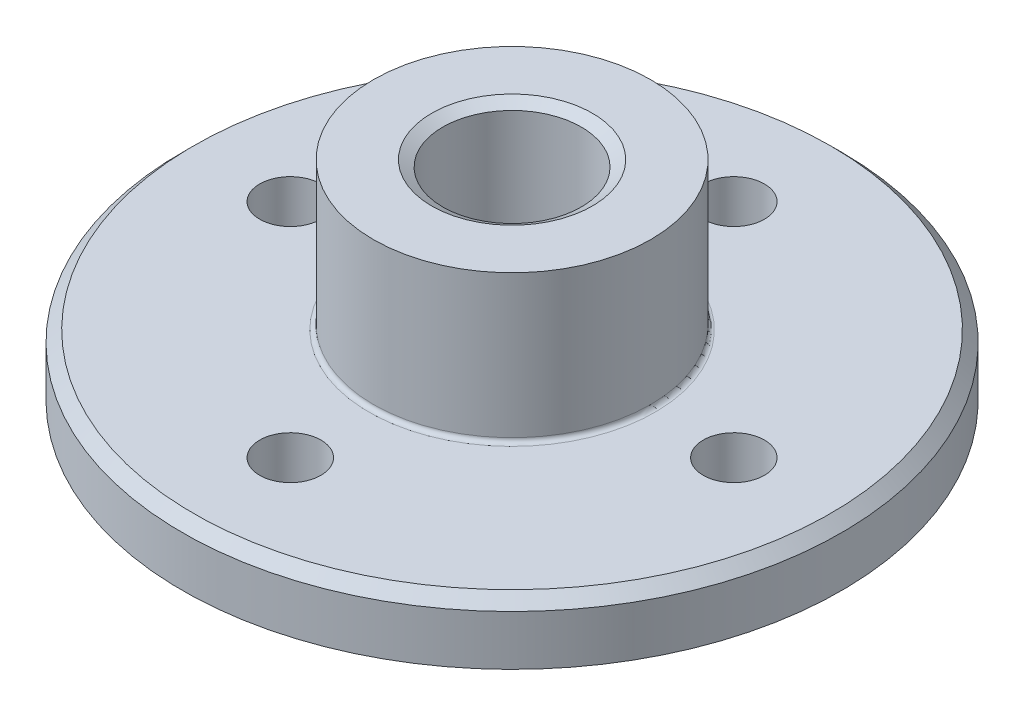
ISO-10303-21;
HEADER;
FILE_DESCRIPTION(('STEP AP214'),'2;1');
FILE_NAME('part.step','',(''),(''),'','','');
FILE_SCHEMA(('AUTOMOTIVE_DESIGN { 1 0 10303 214 1 1 1 1 }'));
ENDSEC;
DATA;
#1=APPLICATION_CONTEXT('core data for automotive mechanical design processes');
#2=APPLICATION_PROTOCOL_DEFINITION('international standard','automotive_design',2000,#1);
#3=PRODUCT_CONTEXT('',#1,'mechanical');
#4=PRODUCT('Part','Part','',(#3));
#5=PRODUCT_RELATED_PRODUCT_CATEGORY('part','',(#4));
#6=PRODUCT_DEFINITION_FORMATION('','',#4);
#7=PRODUCT_DEFINITION_CONTEXT('part definition',#1,'design');
#8=PRODUCT_DEFINITION('design','',#6,#7);
#9=PRODUCT_DEFINITION_SHAPE('','',#8);
#10=(LENGTH_UNIT() NAMED_UNIT(*) SI_UNIT(.MILLI.,.METRE.));
#11=(NAMED_UNIT(*) PLANE_ANGLE_UNIT() SI_UNIT($,.RADIAN.));
#12=(NAMED_UNIT(*) SI_UNIT($,.STERADIAN.) SOLID_ANGLE_UNIT());
#13=UNCERTAINTY_MEASURE_WITH_UNIT(LENGTH_MEASURE(1.E-05),#10,'distance_accuracy_value','');
#14=(GEOMETRIC_REPRESENTATION_CONTEXT(3) GLOBAL_UNCERTAINTY_ASSIGNED_CONTEXT((#13)) GLOBAL_UNIT_ASSIGNED_CONTEXT((#10,
#11,#12)) REPRESENTATION_CONTEXT('',''));
#15=CARTESIAN_POINT('',(0.,0.,0.));
#16=DIRECTION('',(0.,0.,1.));
#17=DIRECTION('',(1.,0.,0.));
#18=AXIS2_PLACEMENT_3D('',#15,#16,#17);
#19=CARTESIAN_POINT('',(-18.8733197120138,-8.9662,0.));
#20=DIRECTION('',(0.,1.,0.));
#21=DIRECTION('',(0.,0.,1.));
#22=AXIS2_PLACEMENT_3D('',#19,#20,#21);
#23=PLANE('',#22);
#24=CARTESIAN_POINT('',(-12.7,-8.9662,1.33025439009923E-13));
#25=DIRECTION('',(0.,-1.,0.));
#26=DIRECTION('',(0.,0.,-1.));
#27=AXIS2_PLACEMENT_3D('',#24,#25,#26);
#28=CIRCLE('',#27,1.75259999999999);
#29=CARTESIAN_POINT('',(-12.7,-8.9662,-1.75259999999985));
#30=VERTEX_POINT('',#29);
#31=EDGE_CURVE('E103',#30,#30,#28,.T.);
#32=ORIENTED_EDGE('',*,*,#31,.F.);
#33=EDGE_LOOP('',(#32));
#34=FACE_BOUND('',#33,.T.);
#35=CARTESIAN_POINT('',(0.,-8.9662,-12.7));
#36=DIRECTION('',(0.,-1.,0.));
#37=DIRECTION('',(0.,0.,-1.));
#38=AXIS2_PLACEMENT_3D('',#35,#36,#37);
#39=CIRCLE('',#38,1.75259999999999);
#40=CARTESIAN_POINT('',(0.,-8.9662,-14.4526));
#41=VERTEX_POINT('',#40);
#42=EDGE_CURVE('E97',#41,#41,#39,.T.);
#43=ORIENTED_EDGE('',*,*,#42,.F.);
#44=EDGE_LOOP('',(#43));
#45=FACE_BOUND('',#44,.T.);
#46=CARTESIAN_POINT('',(12.7,-8.9662,0.));
#47=DIRECTION('',(0.,-1.,0.));
#48=DIRECTION('',(0.,0.,-1.));
#49=AXIS2_PLACEMENT_3D('',#46,#47,#48);
#50=CIRCLE('',#49,1.75259999999999);
#51=CARTESIAN_POINT('',(12.7,-8.9662,-1.75260000000003));
#52=VERTEX_POINT('',#51);
#53=EDGE_CURVE('E91',#52,#52,#50,.T.);
#54=ORIENTED_EDGE('',*,*,#53,.F.);
#55=EDGE_LOOP('',(#54));
#56=FACE_BOUND('',#55,.T.);
#57=CARTESIAN_POINT('',(0.,-8.9662,0.));
#58=DIRECTION('',(0.,-1.,0.));
#59=DIRECTION('',(0.,0.,-1.));
#60=AXIS2_PLACEMENT_3D('',#57,#58,#59);
#61=CIRCLE('',#60,18.8733197120138);
#62=CARTESIAN_POINT('',(0.,-8.9662,-18.8733197120138));
#63=VERTEX_POINT('',#62);
#64=EDGE_CURVE('E73',#63,#63,#61,.T.);
#65=ORIENTED_EDGE('',*,*,#64,.T.);
#66=EDGE_LOOP('',(#65));
#67=FACE_BOUND('',#66,.T.);
#68=CARTESIAN_POINT('',(0.,-8.9662,0.));
#69=DIRECTION('',(0.,1.,0.));
#70=DIRECTION('',(0.,0.,1.));
#71=AXIS2_PLACEMENT_3D('',#68,#69,#70);
#72=CIRCLE('',#71,4.60375);
#73=CARTESIAN_POINT('',(0.,-8.9662,4.60375));
#74=VERTEX_POINT('',#73);
#75=EDGE_CURVE('E79',#74,#74,#72,.T.);
#76=ORIENTED_EDGE('',*,*,#75,.T.);
#77=EDGE_LOOP('',(#76));
#78=FACE_BOUND('',#77,.T.);
#79=CARTESIAN_POINT('',(0.,-8.9662,12.7));
#80=DIRECTION('',(0.,-1.,0.));
#81=DIRECTION('',(0.,0.,-1.));
#82=AXIS2_PLACEMENT_3D('',#79,#80,#81);
#83=CIRCLE('',#82,1.75259999999999);
#84=CARTESIAN_POINT('',(0.,-8.9662,10.9474));
#85=VERTEX_POINT('',#84);
#86=EDGE_CURVE('E85',#85,#85,#83,.T.);
#87=ORIENTED_EDGE('',*,*,#86,.F.);
#88=EDGE_LOOP('',(#87));
#89=FACE_BOUND('',#88,.T.);
#90=ADVANCED_FACE('F44',(#34,#45,#56,#67,#78,#89),#23,.F.);
#91=CARTESIAN_POINT('',(0.,-5.461,0.));
#92=DIRECTION('',(0.,-1.,0.));
#93=DIRECTION('',(1.,0.,0.));
#94=AXIS2_PLACEMENT_3D('',#91,#92,#93);
#95=CYLINDRICAL_SURFACE('',#94,7.9375);
#96=CARTESIAN_POINT('',(0.,-5.207,0.));
#97=DIRECTION('',(0.,-1.,0.));
#98=DIRECTION('',(0.,0.,-1.));
#99=AXIS2_PLACEMENT_3D('',#96,#97,#98);
#100=CIRCLE('',#99,7.9375);
#101=CARTESIAN_POINT('',(0.,-5.207,-7.9375));
#102=VERTEX_POINT('',#101);
#103=EDGE_CURVE('E55',#102,#102,#100,.F.);
#104=ORIENTED_EDGE('',*,*,#103,.T.);
#105=EDGE_LOOP('',(#104));
#106=FACE_BOUND('',#105,.T.);
#107=CARTESIAN_POINT('',(0.,2.9718,0.));
#108=DIRECTION('',(0.,-1.,0.));
#109=DIRECTION('',(1.,0.,0.));
#110=AXIS2_PLACEMENT_3D('',#107,#108,#109);
#111=CIRCLE('',#110,7.9375);
#112=CARTESIAN_POINT('',(7.9375,2.9718,0.));
#113=VERTEX_POINT('',#112);
#114=EDGE_CURVE('E64',#113,#113,#111,.T.);
#115=ORIENTED_EDGE('',*,*,#114,.T.);
#116=EDGE_LOOP('',(#115));
#117=FACE_BOUND('',#116,.T.);
#118=ADVANCED_FACE('F111',(#106,#117),#95,.T.);
#119=CARTESIAN_POINT('',(0.,2.9718,0.));
#120=DIRECTION('',(0.,-1.,0.));
#121=DIRECTION('',(1.,0.,0.));
#122=AXIS2_PLACEMENT_3D('',#119,#120,#121);
#123=PLANE('',#122);
#124=CARTESIAN_POINT('',(0.,2.9718,0.));
#125=DIRECTION('',(0.,1.,0.));
#126=DIRECTION('',(0.,0.,1.));
#127=AXIS2_PLACEMENT_3D('',#124,#125,#126);
#128=CIRCLE('',#127,4.60375);
#129=CARTESIAN_POINT('',(0.,2.9718,4.60375));
#130=VERTEX_POINT('',#129);
#131=EDGE_CURVE('E67',#130,#130,#128,.T.);
#132=ORIENTED_EDGE('',*,*,#131,.F.);
#133=EDGE_LOOP('',(#132));
#134=FACE_BOUND('',#133,.T.);
#135=ORIENTED_EDGE('',*,*,#114,.F.);
#136=EDGE_LOOP('',(#135));
#137=FACE_BOUND('',#136,.T.);
#138=ADVANCED_FACE('F157',(#134,#137),#123,.F.);
#139=CARTESIAN_POINT('',(0.,2.9718,0.));
#140=DIRECTION('',(0.,1.,0.));
#141=DIRECTION('',(0.,0.,1.));
#142=AXIS2_PLACEMENT_3D('',#139,#140,#141);
#143=CONICAL_SURFACE('',#142,4.60375,1.0471975511966);
#144=CARTESIAN_POINT('',(0.,2.60518257906459,0.));
#145=DIRECTION('',(0.,1.,0.));
#146=DIRECTION('',(0.,0.,1.));
#147=AXIS2_PLACEMENT_3D('',#144,#145,#146);
#148=CIRCLE('',#147,3.96875);
#149=CARTESIAN_POINT('',(0.,2.60518257906459,3.96875));
#150=VERTEX_POINT('',#149);
#151=EDGE_CURVE('E70',#150,#150,#148,.T.);
#152=ORIENTED_EDGE('',*,*,#151,.F.);
#153=EDGE_LOOP('',(#152));
#154=FACE_BOUND('',#153,.T.);
#155=ORIENTED_EDGE('',*,*,#131,.T.);
#156=EDGE_LOOP('',(#155));
#157=FACE_BOUND('',#156,.T.);
#158=ADVANCED_FACE('F153',(#154,#157),#143,.F.);
#159=CARTESIAN_POINT('',(0.,2.9718,0.));
#160=DIRECTION('',(0.,1.,0.));
#161=DIRECTION('',(0.,0.,1.));
#162=AXIS2_PLACEMENT_3D('',#159,#160,#161);
#163=CYLINDRICAL_SURFACE('',#162,3.96875);
#164=ORIENTED_EDGE('',*,*,#151,.T.);
#165=EDGE_LOOP('',(#164));
#166=FACE_BOUND('',#165,.T.);
#167=CARTESIAN_POINT('',(0.,-8.59958257906459,0.));
#168=DIRECTION('',(0.,1.,0.));
#169=DIRECTION('',(0.,0.,1.));
#170=AXIS2_PLACEMENT_3D('',#167,#168,#169);
#171=CIRCLE('',#170,3.96875);
#172=CARTESIAN_POINT('',(0.,-8.59958257906459,3.96875));
#173=VERTEX_POINT('',#172);
#174=EDGE_CURVE('E76',#173,#173,#171,.T.);
#175=ORIENTED_EDGE('',*,*,#174,.F.);
#176=EDGE_LOOP('',(#175));
#177=FACE_BOUND('',#176,.T.);
#178=ADVANCED_FACE('F150',(#166,#177),#163,.F.);
#179=CARTESIAN_POINT('',(0.,-5.461,0.));
#180=DIRECTION('',(0.,-1.,0.));
#181=DIRECTION('',(0.,0.,-1.));
#182=AXIS2_PLACEMENT_3D('',#179,#180,#181);
#183=PLANE('',#182);
#184=CARTESIAN_POINT('',(0.,-5.461,0.));
#185=DIRECTION('',(0.,-1.,0.));
#186=DIRECTION('',(0.,0.,-1.));
#187=AXIS2_PLACEMENT_3D('',#184,#185,#186);
#188=CIRCLE('',#187,18.2383197120138);
#189=CARTESIAN_POINT('',(0.,-5.461,-18.2383197120138));
#190=VERTEX_POINT('',#189);
#191=EDGE_CURVE('E12',#190,#190,#188,.F.);
#192=ORIENTED_EDGE('',*,*,#191,.T.);
#193=EDGE_LOOP('',(#192));
#194=FACE_BOUND('',#193,.T.);
#195=CARTESIAN_POINT('',(-12.7,-5.461,1.33025439009923E-13));
#196=DIRECTION('',(0.,-1.,0.));
#197=DIRECTION('',(0.,0.,-1.));
#198=AXIS2_PLACEMENT_3D('',#195,#196,#197);
#199=CIRCLE('',#198,1.75259999999999);
#200=CARTESIAN_POINT('',(-12.7,-5.461,-1.75259999999986));
#201=VERTEX_POINT('',#200);
#202=EDGE_CURVE('E100',#201,#201,#199,.T.);
#203=ORIENTED_EDGE('',*,*,#202,.T.);
#204=EDGE_LOOP('',(#203));
#205=FACE_BOUND('',#204,.T.);
#206=CARTESIAN_POINT('',(0.,-5.461,-12.7));
#207=DIRECTION('',(0.,-1.,0.));
#208=DIRECTION('',(0.,0.,-1.));
#209=AXIS2_PLACEMENT_3D('',#206,#207,#208);
#210=CIRCLE('',#209,1.75259999999999);
#211=CARTESIAN_POINT('',(0.,-5.461,-14.4526));
#212=VERTEX_POINT('',#211);
#213=EDGE_CURVE('E94',#212,#212,#210,.T.);
#214=ORIENTED_EDGE('',*,*,#213,.T.);
#215=EDGE_LOOP('',(#214));
#216=FACE_BOUND('',#215,.T.);
#217=CARTESIAN_POINT('',(12.7,-5.461,0.));
#218=DIRECTION('',(0.,-1.,0.));
#219=DIRECTION('',(0.,0.,-1.));
#220=AXIS2_PLACEMENT_3D('',#217,#218,#219);
#221=CIRCLE('',#220,1.75259999999999);
#222=CARTESIAN_POINT('',(12.7,-5.461,-1.75260000000004));
#223=VERTEX_POINT('',#222);
#224=EDGE_CURVE('E88',#223,#223,#221,.T.);
#225=ORIENTED_EDGE('',*,*,#224,.T.);
#226=EDGE_LOOP('',(#225));
#227=FACE_BOUND('',#226,.T.);
#228=CARTESIAN_POINT('',(0.,-5.461,12.7));
#229=DIRECTION('',(0.,-1.,0.));
#230=DIRECTION('',(0.,0.,-1.));
#231=AXIS2_PLACEMENT_3D('',#228,#229,#230);
#232=CIRCLE('',#231,1.75259999999999);
#233=CARTESIAN_POINT('',(0.,-5.461,10.9474));
#234=VERTEX_POINT('',#233);
#235=EDGE_CURVE('E82',#234,#234,#232,.T.);
#236=ORIENTED_EDGE('',*,*,#235,.T.);
#237=EDGE_LOOP('',(#236));
#238=FACE_BOUND('',#237,.T.);
#239=CARTESIAN_POINT('',(0.,-5.461,0.));
#240=DIRECTION('',(0.,-1.,0.));
#241=DIRECTION('',(0.,0.,-1.));
#242=AXIS2_PLACEMENT_3D('',#239,#240,#241);
#243=CIRCLE('',#242,8.1915);
#244=CARTESIAN_POINT('',(0.,-5.461,-8.1915));
#245=VERTEX_POINT('',#244);
#246=EDGE_CURVE('E59',#245,#245,#243,.T.);
#247=ORIENTED_EDGE('',*,*,#246,.T.);
#248=EDGE_LOOP('',(#247));
#249=FACE_BOUND('',#248,.T.);
#250=ADVANCED_FACE('F147',(#194,#205,#216,#227,#238,#249),#183,.F.);
#251=CARTESIAN_POINT('',(0.,-29.1939599054509,0.));
#252=DIRECTION('',(0.,-1.,0.));
#253=DIRECTION('',(0.,0.,-1.));
#254=AXIS2_PLACEMENT_3D('',#251,#252,#253);
#255=CYLINDRICAL_SURFACE('',#254,18.8733197120138);
#256=CARTESIAN_POINT('',(0.,-6.09600000000001,0.));
#257=DIRECTION('',(0.,-1.,0.));
#258=DIRECTION('',(0.,0.,-1.));
#259=AXIS2_PLACEMENT_3D('',#256,#257,#258);
#260=CIRCLE('',#259,18.8733197120138);
#261=CARTESIAN_POINT('',(0.,-6.09600000000001,-18.8733197120138));
#262=VERTEX_POINT('',#261);
#263=EDGE_CURVE('E51',#262,#262,#260,.T.);
#264=ORIENTED_EDGE('',*,*,#263,.T.);
#265=EDGE_LOOP('',(#264));
#266=FACE_BOUND('',#265,.T.);
#267=ORIENTED_EDGE('',*,*,#64,.F.);
#268=EDGE_LOOP('',(#267));
#269=FACE_BOUND('',#268,.T.);
#270=ADVANCED_FACE('F142',(#266,#269),#255,.T.);
#271=CARTESIAN_POINT('',(0.,-8.59958257906459,0.));
#272=DIRECTION('',(0.,-1.,0.));
#273=DIRECTION('',(0.,0.,-1.));
#274=AXIS2_PLACEMENT_3D('',#271,#272,#273);
#275=CONICAL_SURFACE('',#274,3.96875,1.04719755119659);
#276=ORIENTED_EDGE('',*,*,#75,.F.);
#277=EDGE_LOOP('',(#276));
#278=FACE_BOUND('',#277,.T.);
#279=ORIENTED_EDGE('',*,*,#174,.T.);
#280=EDGE_LOOP('',(#279));
#281=FACE_BOUND('',#280,.T.);
#282=ADVANCED_FACE('F136',(#278,#281),#275,.F.);
#283=CARTESIAN_POINT('',(0.,-5.207,0.));
#284=DIRECTION('',(0.,-1.,0.));
#285=DIRECTION('',(0.,0.,-1.));
#286=AXIS2_PLACEMENT_3D('',#283,#284,#285);
#287=TOROIDAL_SURFACE('',#286,8.1915,0.254);
#288=ORIENTED_EDGE('',*,*,#103,.F.);
#289=EDGE_LOOP('',(#288));
#290=FACE_BOUND('',#289,.T.);
#291=ORIENTED_EDGE('',*,*,#246,.F.);
#292=EDGE_LOOP('',(#291));
#293=FACE_BOUND('',#292,.T.);
#294=ADVANCED_FACE('F126',(#290,#293),#287,.F.);
#295=CARTESIAN_POINT('',(0.,-8.9662,12.7));
#296=DIRECTION('',(0.,-1.,0.));
#297=DIRECTION('',(0.,0.,-1.));
#298=AXIS2_PLACEMENT_3D('',#295,#296,#297);
#299=CYLINDRICAL_SURFACE('',#298,1.75259999999999);
#300=ORIENTED_EDGE('',*,*,#235,.F.);
#301=EDGE_LOOP('',(#300));
#302=FACE_BOUND('',#301,.T.);
#303=ORIENTED_EDGE('',*,*,#86,.T.);
#304=EDGE_LOOP('',(#303));
#305=FACE_BOUND('',#304,.T.);
#306=ADVANCED_FACE('F123',(#302,#305),#299,.F.);
#307=CARTESIAN_POINT('',(12.7,-8.9662,0.));
#308=DIRECTION('',(0.,-1.,0.));
#309=DIRECTION('',(0.,0.,-1.));
#310=AXIS2_PLACEMENT_3D('',#307,#308,#309);
#311=CYLINDRICAL_SURFACE('',#310,1.75259999999999);
#312=ORIENTED_EDGE('',*,*,#224,.F.);
#313=EDGE_LOOP('',(#312));
#314=FACE_BOUND('',#313,.T.);
#315=ORIENTED_EDGE('',*,*,#53,.T.);
#316=EDGE_LOOP('',(#315));
#317=FACE_BOUND('',#316,.T.);
#318=ADVANCED_FACE('F125',(#314,#317),#311,.F.);
#319=CARTESIAN_POINT('',(0.,-8.9662,-12.7));
#320=DIRECTION('',(0.,-1.,0.));
#321=DIRECTION('',(0.,0.,-1.));
#322=AXIS2_PLACEMENT_3D('',#319,#320,#321);
#323=CYLINDRICAL_SURFACE('',#322,1.75259999999999);
#324=ORIENTED_EDGE('',*,*,#213,.F.);
#325=EDGE_LOOP('',(#324));
#326=FACE_BOUND('',#325,.T.);
#327=ORIENTED_EDGE('',*,*,#42,.T.);
#328=EDGE_LOOP('',(#327));
#329=FACE_BOUND('',#328,.T.);
#330=ADVANCED_FACE('F133',(#326,#329),#323,.F.);
#331=CARTESIAN_POINT('',(-12.7,-8.9662,1.33025439009923E-13));
#332=DIRECTION('',(0.,-1.,0.));
#333=DIRECTION('',(0.,0.,-1.));
#334=AXIS2_PLACEMENT_3D('',#331,#332,#333);
#335=CYLINDRICAL_SURFACE('',#334,1.75259999999999);
#336=ORIENTED_EDGE('',*,*,#202,.F.);
#337=EDGE_LOOP('',(#336));
#338=FACE_BOUND('',#337,.T.);
#339=ORIENTED_EDGE('',*,*,#31,.T.);
#340=EDGE_LOOP('',(#339));
#341=FACE_BOUND('',#340,.T.);
#342=ADVANCED_FACE('F107',(#338,#341),#335,.F.);
#343=CARTESIAN_POINT('',(0.,-6.09600000000001,0.));
#344=DIRECTION('',(0.,-1.,0.));
#345=DIRECTION('',(0.,0.,-1.));
#346=AXIS2_PLACEMENT_3D('',#343,#344,#345);
#347=CONICAL_SURFACE('',#346,18.8733197120138,0.785398163397451);
#348=ORIENTED_EDGE('',*,*,#191,.F.);
#349=EDGE_LOOP('',(#348));
#350=FACE_BOUND('',#349,.T.);
#351=ORIENTED_EDGE('',*,*,#263,.F.);
#352=EDGE_LOOP('',(#351));
#353=FACE_BOUND('',#352,.T.);
#354=ADVANCED_FACE('F46',(#350,#353),#347,.T.);
#355=CLOSED_SHELL('',(#90,#118,#138,#158,#178,#250,#270,#282,#294,#306,#318,#330,#342,#354));
#356=MANIFOLD_SOLID_BREP('B2',#355);
#357=ADVANCED_BREP_SHAPE_REPRESENTATION('',(#18,#356),#14);
#358=SHAPE_DEFINITION_REPRESENTATION(#9,#357);
ENDSEC;
END-ISO-10303-21;
